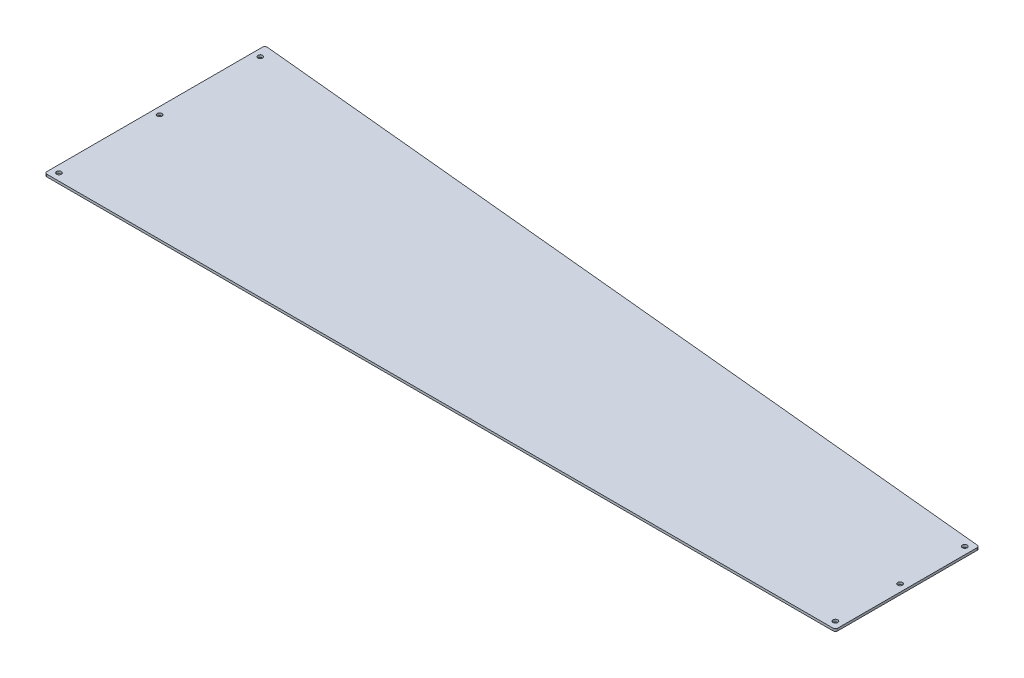
ISO-10303-21;
HEADER;
FILE_DESCRIPTION(('STEP AP214'),'2;1');
FILE_NAME('part.step','',(''),(''),'','','');
FILE_SCHEMA(('AUTOMOTIVE_DESIGN { 1 0 10303 214 1 1 1 1 }'));
ENDSEC;
DATA;
#1=APPLICATION_CONTEXT('core data for automotive mechanical design processes');
#2=APPLICATION_PROTOCOL_DEFINITION('international standard','automotive_design',2000,#1);
#3=PRODUCT_CONTEXT('',#1,'mechanical');
#4=PRODUCT('Part','Part','',(#3));
#5=PRODUCT_RELATED_PRODUCT_CATEGORY('part','',(#4));
#6=PRODUCT_DEFINITION_FORMATION('','',#4);
#7=PRODUCT_DEFINITION_CONTEXT('part definition',#1,'design');
#8=PRODUCT_DEFINITION('design','',#6,#7);
#9=PRODUCT_DEFINITION_SHAPE('','',#8);
#10=(LENGTH_UNIT() NAMED_UNIT(*) SI_UNIT(.MILLI.,.METRE.));
#11=(NAMED_UNIT(*) PLANE_ANGLE_UNIT() SI_UNIT($,.RADIAN.));
#12=(NAMED_UNIT(*) SI_UNIT($,.STERADIAN.) SOLID_ANGLE_UNIT());
#13=UNCERTAINTY_MEASURE_WITH_UNIT(LENGTH_MEASURE(1.E-05),#10,'distance_accuracy_value','');
#14=(GEOMETRIC_REPRESENTATION_CONTEXT(3) GLOBAL_UNCERTAINTY_ASSIGNED_CONTEXT((#13)) GLOBAL_UNIT_ASSIGNED_CONTEXT((#10,
#11,#12)) REPRESENTATION_CONTEXT('',''));
#15=CARTESIAN_POINT('',(0.,0.,0.));
#16=DIRECTION('',(0.,0.,1.));
#17=DIRECTION('',(1.,0.,0.));
#18=AXIS2_PLACEMENT_3D('',#15,#16,#17);
#19=CARTESIAN_POINT('',(413.585526315789,3.175,-75.1973684210526));
#20=DIRECTION('',(-1.,0.,0.));
#21=DIRECTION('',(0.,0.,1.));
#22=AXIS2_PLACEMENT_3D('',#19,#20,#21);
#23=PLANE('',#22);
#24=DIRECTION('',(0.,0.,-1.));
#25=VECTOR('',#24,1.);
#26=CARTESIAN_POINT('',(413.585526315789,3.175,-75.1973684210526));
#27=LINE('',#26,#25);
#28=CARTESIAN_POINT('',(413.585526315789,3.175,112.127631578947));
#29=VERTEX_POINT('',#28);
#30=CARTESIAN_POINT('',(413.585526315789,3.175,-72.3153546797032));
#31=VERTEX_POINT('',#30);
#32=EDGE_CURVE('E124',#29,#31,#27,.T.);
#33=ORIENTED_EDGE('',*,*,#32,.F.);
#34=DIRECTION('',(0.,-1.,0.));
#35=VECTOR('',#34,1.);
#36=CARTESIAN_POINT('',(413.585526315789,3.175,112.127631578947));
#37=LINE('',#36,#35);
#38=CARTESIAN_POINT('',(413.585526315789,0.,112.127631578947));
#39=VERTEX_POINT('',#38);
#40=EDGE_CURVE('E108',#29,#39,#37,.T.);
#41=ORIENTED_EDGE('',*,*,#40,.T.);
#42=DIRECTION('',(0.,0.,-1.));
#43=VECTOR('',#42,1.);
#44=CARTESIAN_POINT('',(413.585526315789,0.,-75.1973684210526));
#45=LINE('',#44,#43);
#46=CARTESIAN_POINT('',(413.585526315789,0.,-72.3153546797032));
#47=VERTEX_POINT('',#46);
#48=EDGE_CURVE('E121',#39,#47,#45,.T.);
#49=ORIENTED_EDGE('',*,*,#48,.T.);
#50=DIRECTION('',(0.,-1.,0.));
#51=VECTOR('',#50,1.);
#52=CARTESIAN_POINT('',(413.585526315789,3.175,-72.3153546797032));
#53=LINE('',#52,#51);
#54=EDGE_CURVE('E127',#47,#31,#53,.F.);
#55=ORIENTED_EDGE('',*,*,#54,.T.);
#56=EDGE_LOOP('',(#33,#41,#49,#55));
#57=FACE_BOUND('',#56,.T.);
#58=ADVANCED_FACE('F38',(#57),#23,.F.);
#59=CARTESIAN_POINT('',(-634.164473684211,3.175,-176.797368421053));
#60=DIRECTION('',(-0.0965169782548387,0.,0.995331338253024));
#61=DIRECTION('',(0.995331338253024,0.,0.0965169782548386));
#62=AXIS2_PLACEMENT_3D('',#59,#60,#61);
#63=PLANE('',#62);
#64=DIRECTION('',(-0.995331338253024,0.,-0.0965169782548386));
#65=VECTOR('',#64,1.);
#66=CARTESIAN_POINT('',(-634.164473684211,3.175,-176.797368421053));
#67=LINE('',#66,#65);
#68=CARTESIAN_POINT('',(410.716967721748,3.175,-75.4755316786566));
#69=VERTEX_POINT('',#68);
#70=CARTESIAN_POINT('',(-630.683032278251,3.175,-176.459774102899));
#71=VERTEX_POINT('',#70);
#72=EDGE_CURVE('E203',#69,#71,#67,.T.);
#73=ORIENTED_EDGE('',*,*,#72,.F.);
#74=DIRECTION('',(0.,-1.,0.));
#75=VECTOR('',#74,1.);
#76=CARTESIAN_POINT('',(410.716967721749,3.175,-75.4755316786566));
#77=LINE('',#76,#75);
#78=CARTESIAN_POINT('',(410.716967721748,0.,-75.4755316786566));
#79=VERTEX_POINT('',#78);
#80=EDGE_CURVE('E181',#69,#79,#77,.T.);
#81=ORIENTED_EDGE('',*,*,#80,.T.);
#82=DIRECTION('',(-0.995331338253024,0.,-0.0965169782548386));
#83=VECTOR('',#82,1.);
#84=CARTESIAN_POINT('',(-634.164473684211,0.,-176.797368421053));
#85=LINE('',#84,#83);
#86=CARTESIAN_POINT('',(-630.683032278251,0.,-176.459774102899));
#87=VERTEX_POINT('',#86);
#88=EDGE_CURVE('E132',#79,#87,#85,.T.);
#89=ORIENTED_EDGE('',*,*,#88,.T.);
#90=DIRECTION('',(0.,-1.,0.));
#91=VECTOR('',#90,1.);
#92=CARTESIAN_POINT('',(-630.683032278251,3.175,-176.459774102899));
#93=LINE('',#92,#91);
#94=EDGE_CURVE('E178',#87,#71,#93,.F.);
#95=ORIENTED_EDGE('',*,*,#94,.T.);
#96=EDGE_LOOP('',(#73,#81,#89,#95));
#97=FACE_BOUND('',#96,.T.);
#98=ADVANCED_FACE('F285',(#97),#63,.F.);
#99=CARTESIAN_POINT('',(-634.164473684211,3.175,-176.797368421053));
#100=DIRECTION('',(1.,0.,0.));
#101=DIRECTION('',(0.,0.,-1.));
#102=AXIS2_PLACEMENT_3D('',#99,#100,#101);
#103=PLANE('',#102);
#104=DIRECTION('',(0.,0.,1.));
#105=VECTOR('',#104,1.);
#106=CARTESIAN_POINT('',(-634.164473684211,0.,-176.797368421053));
#107=LINE('',#106,#105);
#108=CARTESIAN_POINT('',(-634.164473684211,0.,-173.299597103946));
#109=VERTEX_POINT('',#108);
#110=CARTESIAN_POINT('',(-634.164473684211,0.,112.127631578947));
#111=VERTEX_POINT('',#110);
#112=EDGE_CURVE('E139',#109,#111,#107,.T.);
#113=ORIENTED_EDGE('',*,*,#112,.T.);
#114=DIRECTION('',(0.,-1.,0.));
#115=VECTOR('',#114,1.);
#116=CARTESIAN_POINT('',(-634.164473684211,3.175,112.127631578947));
#117=LINE('',#116,#115);
#118=CARTESIAN_POINT('',(-634.164473684211,3.175,112.127631578947));
#119=VERTEX_POINT('',#118);
#120=EDGE_CURVE('E11',#111,#119,#117,.F.);
#121=ORIENTED_EDGE('',*,*,#120,.T.);
#122=DIRECTION('',(0.,0.,1.));
#123=VECTOR('',#122,1.);
#124=CARTESIAN_POINT('',(-634.164473684211,3.175,-176.797368421053));
#125=LINE('',#124,#123);
#126=CARTESIAN_POINT('',(-634.164473684211,3.175,-173.299597103946));
#127=VERTEX_POINT('',#126);
#128=EDGE_CURVE('E190',#127,#119,#125,.T.);
#129=ORIENTED_EDGE('',*,*,#128,.F.);
#130=DIRECTION('',(0.,-1.,0.));
#131=VECTOR('',#130,1.);
#132=CARTESIAN_POINT('',(-634.164473684211,3.175,-173.299597103946));
#133=LINE('',#132,#131);
#134=EDGE_CURVE('E47',#127,#109,#133,.T.);
#135=ORIENTED_EDGE('',*,*,#134,.T.);
#136=EDGE_LOOP('',(#113,#121,#129,#135));
#137=FACE_BOUND('',#136,.T.);
#138=ADVANCED_FACE('F189',(#137),#103,.F.);
#139=CARTESIAN_POINT('',(-634.164473684211,3.175,115.302631578947));
#140=DIRECTION('',(0.,0.,-1.));
#141=DIRECTION('',(-1.,0.,0.));
#142=AXIS2_PLACEMENT_3D('',#139,#140,#141);
#143=PLANE('',#142);
#144=DIRECTION('',(1.,0.,0.));
#145=VECTOR('',#144,1.);
#146=CARTESIAN_POINT('',(-634.164473684211,0.,115.302631578947));
#147=LINE('',#146,#145);
#148=CARTESIAN_POINT('',(-630.98947368421,0.,115.302631578947));
#149=VERTEX_POINT('',#148);
#150=CARTESIAN_POINT('',(410.41052631579,0.,115.302631578947));
#151=VERTEX_POINT('',#150);
#152=EDGE_CURVE('E150',#149,#151,#147,.T.);
#153=ORIENTED_EDGE('',*,*,#152,.T.);
#154=DIRECTION('',(0.,-1.,0.));
#155=VECTOR('',#154,1.);
#156=CARTESIAN_POINT('',(410.41052631579,3.175,115.302631578947));
#157=LINE('',#156,#155);
#158=CARTESIAN_POINT('',(410.41052631579,3.175,115.302631578947));
#159=VERTEX_POINT('',#158);
#160=EDGE_CURVE('E109',#151,#159,#157,.F.);
#161=ORIENTED_EDGE('',*,*,#160,.T.);
#162=DIRECTION('',(1.,0.,0.));
#163=VECTOR('',#162,1.);
#164=CARTESIAN_POINT('',(-634.164473684211,3.175,115.302631578947));
#165=LINE('',#164,#163);
#166=CARTESIAN_POINT('',(-630.98947368421,3.175,115.302631578947));
#167=VERTEX_POINT('',#166);
#168=EDGE_CURVE('E145',#167,#159,#165,.T.);
#169=ORIENTED_EDGE('',*,*,#168,.F.);
#170=DIRECTION('',(0.,-1.,0.));
#171=VECTOR('',#170,1.);
#172=CARTESIAN_POINT('',(-630.98947368421,3.175,115.302631578947));
#173=LINE('',#172,#171);
#174=EDGE_CURVE('E115',#167,#149,#173,.T.);
#175=ORIENTED_EDGE('',*,*,#174,.T.);
#176=EDGE_LOOP('',(#153,#161,#169,#175));
#177=FACE_BOUND('',#176,.T.);
#178=ADVANCED_FACE('F198',(#177),#143,.F.);
#179=CARTESIAN_POINT('',(0.,3.175,0.));
#180=DIRECTION('',(0.,1.,0.));
#181=DIRECTION('',(0.,0.,1.));
#182=AXIS2_PLACEMENT_3D('',#179,#180,#181);
#183=PLANE('',#182);
#184=CARTESIAN_POINT('',(404.06052631579,3.175,-65.6723684210526));
#185=DIRECTION('',(0.,1.,0.));
#186=DIRECTION('',(0.,0.,1.));
#187=AXIS2_PLACEMENT_3D('',#184,#185,#186);
#188=CIRCLE('',#187,3.17499999999998);
#189=CARTESIAN_POINT('',(404.06052631579,3.175,-62.4973684210526));
#190=VERTEX_POINT('',#189);
#191=EDGE_CURVE('E249',#190,#190,#188,.T.);
#192=ORIENTED_EDGE('',*,*,#191,.F.);
#193=EDGE_LOOP('',(#192));
#194=FACE_BOUND('',#193,.T.);
#195=CARTESIAN_POINT('',(404.06052631579,3.175,20.0526315789474));
#196=DIRECTION('',(0.,1.,0.));
#197=DIRECTION('',(0.,0.,1.));
#198=AXIS2_PLACEMENT_3D('',#195,#196,#197);
#199=CIRCLE('',#198,3.17499999999998);
#200=CARTESIAN_POINT('',(404.06052631579,3.175,23.2276315789474));
#201=VERTEX_POINT('',#200);
#202=EDGE_CURVE('E241',#201,#201,#199,.T.);
#203=ORIENTED_EDGE('',*,*,#202,.F.);
#204=EDGE_LOOP('',(#203));
#205=FACE_BOUND('',#204,.T.);
#206=CARTESIAN_POINT('',(404.06052631579,3.175,105.777631578947));
#207=DIRECTION('',(0.,1.,0.));
#208=DIRECTION('',(0.,0.,1.));
#209=AXIS2_PLACEMENT_3D('',#206,#207,#208);
#210=CIRCLE('',#209,3.17499999999998);
#211=CARTESIAN_POINT('',(404.06052631579,3.175,108.952631578947));
#212=VERTEX_POINT('',#211);
#213=EDGE_CURVE('E233',#212,#212,#210,.T.);
#214=ORIENTED_EDGE('',*,*,#213,.F.);
#215=EDGE_LOOP('',(#214));
#216=FACE_BOUND('',#215,.T.);
#217=CARTESIAN_POINT('',(-624.63947368421,3.175,105.777631578947));
#218=DIRECTION('',(0.,1.,0.));
#219=DIRECTION('',(0.,0.,1.));
#220=AXIS2_PLACEMENT_3D('',#217,#218,#219);
#221=CIRCLE('',#220,3.17500000000004);
#222=CARTESIAN_POINT('',(-624.63947368421,3.175,108.952631578947));
#223=VERTEX_POINT('',#222);
#224=EDGE_CURVE('E225',#223,#223,#221,.T.);
#225=ORIENTED_EDGE('',*,*,#224,.F.);
#226=EDGE_LOOP('',(#225));
#227=FACE_BOUND('',#226,.T.);
#228=CARTESIAN_POINT('',(-624.63947368421,3.175,-27.5723684210527));
#229=DIRECTION('',(0.,1.,0.));
#230=DIRECTION('',(0.,0.,1.));
#231=AXIS2_PLACEMENT_3D('',#228,#229,#230);
#232=CIRCLE('',#231,3.17500000000004);
#233=CARTESIAN_POINT('',(-624.63947368421,3.175,-24.3973684210526));
#234=VERTEX_POINT('',#233);
#235=EDGE_CURVE('E217',#234,#234,#232,.T.);
#236=ORIENTED_EDGE('',*,*,#235,.F.);
#237=EDGE_LOOP('',(#236));
#238=FACE_BOUND('',#237,.T.);
#239=CARTESIAN_POINT('',(-624.63947368421,3.175,-160.922368421053));
#240=DIRECTION('',(0.,1.,0.));
#241=DIRECTION('',(0.,0.,1.));
#242=AXIS2_PLACEMENT_3D('',#239,#240,#241);
#243=CIRCLE('',#242,3.17500000000004);
#244=CARTESIAN_POINT('',(-624.63947368421,3.175,-157.747368421053));
#245=VERTEX_POINT('',#244);
#246=EDGE_CURVE('E142',#245,#245,#243,.T.);
#247=ORIENTED_EDGE('',*,*,#246,.F.);
#248=EDGE_LOOP('',(#247));
#249=FACE_BOUND('',#248,.T.);
#250=ORIENTED_EDGE('',*,*,#168,.T.);
#251=CARTESIAN_POINT('',(410.41052631579,3.175,112.127631578947));
#252=DIRECTION('',(0.,1.,0.));
#253=DIRECTION('',(0.,0.,1.));
#254=AXIS2_PLACEMENT_3D('',#251,#252,#253);
#255=CIRCLE('',#254,3.175);
#256=EDGE_CURVE('E175',#159,#29,#255,.T.);
#257=ORIENTED_EDGE('',*,*,#256,.T.);
#258=ORIENTED_EDGE('',*,*,#32,.T.);
#259=CARTESIAN_POINT('',(410.410526315789,3.175,-72.3153546797032));
#260=DIRECTION('',(0.,1.,0.));
#261=DIRECTION('',(0.,0.,1.));
#262=AXIS2_PLACEMENT_3D('',#259,#260,#261);
#263=CIRCLE('',#262,3.175);
#264=EDGE_CURVE('E172',#31,#69,#263,.T.);
#265=ORIENTED_EDGE('',*,*,#264,.T.);
#266=ORIENTED_EDGE('',*,*,#72,.T.);
#267=CARTESIAN_POINT('',(-630.98947368421,3.175,-173.299597103946));
#268=DIRECTION('',(0.,1.,0.));
#269=DIRECTION('',(0.,0.,1.));
#270=AXIS2_PLACEMENT_3D('',#267,#268,#269);
#271=CIRCLE('',#270,3.175);
#272=EDGE_CURVE('E59',#71,#127,#271,.T.);
#273=ORIENTED_EDGE('',*,*,#272,.T.);
#274=ORIENTED_EDGE('',*,*,#128,.T.);
#275=CARTESIAN_POINT('',(-630.98947368421,3.175,112.127631578947));
#276=DIRECTION('',(0.,1.,0.));
#277=DIRECTION('',(0.,0.,1.));
#278=AXIS2_PLACEMENT_3D('',#275,#276,#277);
#279=CIRCLE('',#278,3.175);
#280=EDGE_CURVE('E169',#119,#167,#279,.T.);
#281=ORIENTED_EDGE('',*,*,#280,.T.);
#282=EDGE_LOOP('',(#250,#257,#258,#265,#266,#273,#274,#281));
#283=FACE_BOUND('',#282,.T.);
#284=ADVANCED_FACE('F257',(#194,#205,#216,#227,#238,#249,#283),#183,.T.);
#285=CARTESIAN_POINT('',(0.,0.,0.));
#286=DIRECTION('',(0.,1.,0.));
#287=DIRECTION('',(0.,0.,1.));
#288=AXIS2_PLACEMENT_3D('',#285,#286,#287);
#289=PLANE('',#288);
#290=CARTESIAN_POINT('',(404.06052631579,0.,-65.6723684210526));
#291=DIRECTION('',(0.,1.,0.));
#292=DIRECTION('',(0.,0.,1.));
#293=AXIS2_PLACEMENT_3D('',#290,#291,#292);
#294=CIRCLE('',#293,3.17499999999998);
#295=CARTESIAN_POINT('',(404.06052631579,0.,-62.4973684210526));
#296=VERTEX_POINT('',#295);
#297=EDGE_CURVE('E245',#296,#296,#294,.T.);
#298=ORIENTED_EDGE('',*,*,#297,.T.);
#299=EDGE_LOOP('',(#298));
#300=FACE_BOUND('',#299,.T.);
#301=CARTESIAN_POINT('',(404.06052631579,0.,20.0526315789474));
#302=DIRECTION('',(0.,1.,0.));
#303=DIRECTION('',(0.,0.,1.));
#304=AXIS2_PLACEMENT_3D('',#301,#302,#303);
#305=CIRCLE('',#304,3.17499999999998);
#306=CARTESIAN_POINT('',(404.06052631579,0.,23.2276315789474));
#307=VERTEX_POINT('',#306);
#308=EDGE_CURVE('E237',#307,#307,#305,.T.);
#309=ORIENTED_EDGE('',*,*,#308,.T.);
#310=EDGE_LOOP('',(#309));
#311=FACE_BOUND('',#310,.T.);
#312=CARTESIAN_POINT('',(404.06052631579,0.,105.777631578947));
#313=DIRECTION('',(0.,1.,0.));
#314=DIRECTION('',(0.,0.,1.));
#315=AXIS2_PLACEMENT_3D('',#312,#313,#314);
#316=CIRCLE('',#315,3.17499999999998);
#317=CARTESIAN_POINT('',(404.06052631579,0.,108.952631578947));
#318=VERTEX_POINT('',#317);
#319=EDGE_CURVE('E229',#318,#318,#316,.T.);
#320=ORIENTED_EDGE('',*,*,#319,.T.);
#321=EDGE_LOOP('',(#320));
#322=FACE_BOUND('',#321,.T.);
#323=CARTESIAN_POINT('',(-624.63947368421,0.,105.777631578947));
#324=DIRECTION('',(0.,1.,0.));
#325=DIRECTION('',(0.,0.,1.));
#326=AXIS2_PLACEMENT_3D('',#323,#324,#325);
#327=CIRCLE('',#326,3.17500000000004);
#328=CARTESIAN_POINT('',(-624.63947368421,0.,108.952631578947));
#329=VERTEX_POINT('',#328);
#330=EDGE_CURVE('E221',#329,#329,#327,.T.);
#331=ORIENTED_EDGE('',*,*,#330,.T.);
#332=EDGE_LOOP('',(#331));
#333=FACE_BOUND('',#332,.T.);
#334=CARTESIAN_POINT('',(-624.63947368421,0.,-27.5723684210527));
#335=DIRECTION('',(0.,1.,0.));
#336=DIRECTION('',(0.,0.,1.));
#337=AXIS2_PLACEMENT_3D('',#334,#335,#336);
#338=CIRCLE('',#337,3.17500000000004);
#339=CARTESIAN_POINT('',(-624.63947368421,0.,-24.3973684210526));
#340=VERTEX_POINT('',#339);
#341=EDGE_CURVE('E213',#340,#340,#338,.T.);
#342=ORIENTED_EDGE('',*,*,#341,.T.);
#343=EDGE_LOOP('',(#342));
#344=FACE_BOUND('',#343,.T.);
#345=CARTESIAN_POINT('',(-624.63947368421,0.,-160.922368421053));
#346=DIRECTION('',(0.,1.,0.));
#347=DIRECTION('',(0.,0.,1.));
#348=AXIS2_PLACEMENT_3D('',#345,#346,#347);
#349=CIRCLE('',#348,3.17500000000004);
#350=CARTESIAN_POINT('',(-624.63947368421,0.,-157.747368421053));
#351=VERTEX_POINT('',#350);
#352=EDGE_CURVE('E133',#351,#351,#349,.T.);
#353=ORIENTED_EDGE('',*,*,#352,.T.);
#354=EDGE_LOOP('',(#353));
#355=FACE_BOUND('',#354,.T.);
#356=ORIENTED_EDGE('',*,*,#48,.F.);
#357=CARTESIAN_POINT('',(410.41052631579,0.,112.127631578947));
#358=DIRECTION('',(0.,1.,0.));
#359=DIRECTION('',(0.,0.,1.));
#360=AXIS2_PLACEMENT_3D('',#357,#358,#359);
#361=CIRCLE('',#360,3.175);
#362=EDGE_CURVE('E104',#39,#151,#361,.F.);
#363=ORIENTED_EDGE('',*,*,#362,.T.);
#364=ORIENTED_EDGE('',*,*,#152,.F.);
#365=CARTESIAN_POINT('',(-630.98947368421,0.,112.127631578947));
#366=DIRECTION('',(0.,1.,0.));
#367=DIRECTION('',(0.,0.,1.));
#368=AXIS2_PLACEMENT_3D('',#365,#366,#367);
#369=CIRCLE('',#368,3.175);
#370=EDGE_CURVE('E157',#149,#111,#369,.F.);
#371=ORIENTED_EDGE('',*,*,#370,.T.);
#372=ORIENTED_EDGE('',*,*,#112,.F.);
#373=CARTESIAN_POINT('',(-630.98947368421,0.,-173.299597103946));
#374=DIRECTION('',(0.,1.,0.));
#375=DIRECTION('',(0.,0.,1.));
#376=AXIS2_PLACEMENT_3D('',#373,#374,#375);
#377=CIRCLE('',#376,3.175);
#378=EDGE_CURVE('E126',#109,#87,#377,.F.);
#379=ORIENTED_EDGE('',*,*,#378,.T.);
#380=ORIENTED_EDGE('',*,*,#88,.F.);
#381=CARTESIAN_POINT('',(410.410526315789,0.,-72.3153546797032));
#382=DIRECTION('',(0.,1.,0.));
#383=DIRECTION('',(0.,0.,1.));
#384=AXIS2_PLACEMENT_3D('',#381,#382,#383);
#385=CIRCLE('',#384,3.175);
#386=EDGE_CURVE('E116',#79,#47,#385,.F.);
#387=ORIENTED_EDGE('',*,*,#386,.T.);
#388=EDGE_LOOP('',(#356,#363,#364,#371,#372,#379,#380,#387));
#389=FACE_BOUND('',#388,.T.);
#390=ADVANCED_FACE('F129',(#300,#311,#322,#333,#344,#355,#389),#289,.F.);
#391=CARTESIAN_POINT('',(410.41052631579,3.175,112.127631578947));
#392=DIRECTION('',(0.,-1.,0.));
#393=DIRECTION('',(0.,0.,-1.));
#394=AXIS2_PLACEMENT_3D('',#391,#392,#393);
#395=CYLINDRICAL_SURFACE('',#394,3.175);
#396=ORIENTED_EDGE('',*,*,#256,.F.);
#397=ORIENTED_EDGE('',*,*,#160,.F.);
#398=ORIENTED_EDGE('',*,*,#362,.F.);
#399=ORIENTED_EDGE('',*,*,#40,.F.);
#400=EDGE_LOOP('',(#396,#397,#398,#399));
#401=FACE_BOUND('',#400,.T.);
#402=ADVANCED_FACE('F107',(#401),#395,.T.);
#403=CARTESIAN_POINT('',(410.410526315789,3.175,-72.3153546797032));
#404=DIRECTION('',(0.,-1.,0.));
#405=DIRECTION('',(0.,0.,-1.));
#406=AXIS2_PLACEMENT_3D('',#403,#404,#405);
#407=CYLINDRICAL_SURFACE('',#406,3.175);
#408=ORIENTED_EDGE('',*,*,#264,.F.);
#409=ORIENTED_EDGE('',*,*,#54,.F.);
#410=ORIENTED_EDGE('',*,*,#386,.F.);
#411=ORIENTED_EDGE('',*,*,#80,.F.);
#412=EDGE_LOOP('',(#408,#409,#410,#411));
#413=FACE_BOUND('',#412,.T.);
#414=ADVANCED_FACE('F296',(#413),#407,.T.);
#415=CARTESIAN_POINT('',(-630.98947368421,3.175,112.127631578947));
#416=DIRECTION('',(0.,-1.,0.));
#417=DIRECTION('',(0.,0.,-1.));
#418=AXIS2_PLACEMENT_3D('',#415,#416,#417);
#419=CYLINDRICAL_SURFACE('',#418,3.175);
#420=ORIENTED_EDGE('',*,*,#280,.F.);
#421=ORIENTED_EDGE('',*,*,#120,.F.);
#422=ORIENTED_EDGE('',*,*,#370,.F.);
#423=ORIENTED_EDGE('',*,*,#174,.F.);
#424=EDGE_LOOP('',(#420,#421,#422,#423));
#425=FACE_BOUND('',#424,.T.);
#426=ADVANCED_FACE('F195',(#425),#419,.T.);
#427=CARTESIAN_POINT('',(-630.98947368421,3.175,-173.299597103946));
#428=DIRECTION('',(0.,-1.,0.));
#429=DIRECTION('',(0.,0.,-1.));
#430=AXIS2_PLACEMENT_3D('',#427,#428,#429);
#431=CYLINDRICAL_SURFACE('',#430,3.175);
#432=ORIENTED_EDGE('',*,*,#272,.F.);
#433=ORIENTED_EDGE('',*,*,#94,.F.);
#434=ORIENTED_EDGE('',*,*,#378,.F.);
#435=ORIENTED_EDGE('',*,*,#134,.F.);
#436=EDGE_LOOP('',(#432,#433,#434,#435));
#437=FACE_BOUND('',#436,.T.);
#438=ADVANCED_FACE('F40',(#437),#431,.T.);
#439=CARTESIAN_POINT('',(-624.63947368421,3.175,-160.922368421053));
#440=DIRECTION('',(0.,1.,0.));
#441=DIRECTION('',(0.,0.,1.));
#442=AXIS2_PLACEMENT_3D('',#439,#440,#441);
#443=CYLINDRICAL_SURFACE('',#442,3.17500000000004);
#444=ORIENTED_EDGE('',*,*,#352,.F.);
#445=EDGE_LOOP('',(#444));
#446=FACE_BOUND('',#445,.T.);
#447=ORIENTED_EDGE('',*,*,#246,.T.);
#448=EDGE_LOOP('',(#447));
#449=FACE_BOUND('',#448,.T.);
#450=ADVANCED_FACE('F271',(#446,#449),#443,.F.);
#451=CARTESIAN_POINT('',(-624.63947368421,3.175,-27.5723684210527));
#452=DIRECTION('',(0.,1.,0.));
#453=DIRECTION('',(0.,0.,1.));
#454=AXIS2_PLACEMENT_3D('',#451,#452,#453);
#455=CYLINDRICAL_SURFACE('',#454,3.17500000000004);
#456=ORIENTED_EDGE('',*,*,#341,.F.);
#457=EDGE_LOOP('',(#456));
#458=FACE_BOUND('',#457,.T.);
#459=ORIENTED_EDGE('',*,*,#235,.T.);
#460=EDGE_LOOP('',(#459));
#461=FACE_BOUND('',#460,.T.);
#462=ADVANCED_FACE('F273',(#458,#461),#455,.F.);
#463=CARTESIAN_POINT('',(-624.63947368421,3.175,105.777631578947));
#464=DIRECTION('',(0.,1.,0.));
#465=DIRECTION('',(0.,0.,1.));
#466=AXIS2_PLACEMENT_3D('',#463,#464,#465);
#467=CYLINDRICAL_SURFACE('',#466,3.17500000000004);
#468=ORIENTED_EDGE('',*,*,#330,.F.);
#469=EDGE_LOOP('',(#468));
#470=FACE_BOUND('',#469,.T.);
#471=ORIENTED_EDGE('',*,*,#224,.T.);
#472=EDGE_LOOP('',(#471));
#473=FACE_BOUND('',#472,.T.);
#474=ADVANCED_FACE('F280',(#470,#473),#467,.F.);
#475=CARTESIAN_POINT('',(404.06052631579,3.175,105.777631578947));
#476=DIRECTION('',(0.,1.,0.));
#477=DIRECTION('',(0.,0.,1.));
#478=AXIS2_PLACEMENT_3D('',#475,#476,#477);
#479=CYLINDRICAL_SURFACE('',#478,3.17499999999998);
#480=ORIENTED_EDGE('',*,*,#319,.F.);
#481=EDGE_LOOP('',(#480));
#482=FACE_BOUND('',#481,.T.);
#483=ORIENTED_EDGE('',*,*,#213,.T.);
#484=EDGE_LOOP('',(#483));
#485=FACE_BOUND('',#484,.T.);
#486=ADVANCED_FACE('F329',(#482,#485),#479,.F.);
#487=CARTESIAN_POINT('',(404.06052631579,3.175,20.0526315789474));
#488=DIRECTION('',(0.,1.,0.));
#489=DIRECTION('',(0.,0.,1.));
#490=AXIS2_PLACEMENT_3D('',#487,#488,#489);
#491=CYLINDRICAL_SURFACE('',#490,3.17499999999998);
#492=ORIENTED_EDGE('',*,*,#308,.F.);
#493=EDGE_LOOP('',(#492));
#494=FACE_BOUND('',#493,.T.);
#495=ORIENTED_EDGE('',*,*,#202,.T.);
#496=EDGE_LOOP('',(#495));
#497=FACE_BOUND('',#496,.T.);
#498=ADVANCED_FACE('F339',(#494,#497),#491,.F.);
#499=CARTESIAN_POINT('',(404.06052631579,3.175,-65.6723684210526));
#500=DIRECTION('',(0.,1.,0.));
#501=DIRECTION('',(0.,0.,1.));
#502=AXIS2_PLACEMENT_3D('',#499,#500,#501);
#503=CYLINDRICAL_SURFACE('',#502,3.17499999999998);
#504=ORIENTED_EDGE('',*,*,#297,.F.);
#505=EDGE_LOOP('',(#504));
#506=FACE_BOUND('',#505,.T.);
#507=ORIENTED_EDGE('',*,*,#191,.T.);
#508=EDGE_LOOP('',(#507));
#509=FACE_BOUND('',#508,.T.);
#510=ADVANCED_FACE('F255',(#506,#509),#503,.F.);
#511=CLOSED_SHELL('',(#58,#98,#138,#178,#284,#390,#402,#414,#426,#438,#450,#462,#474,#486,#498,#510));
#512=MANIFOLD_SOLID_BREP('B2',#511);
#513=ADVANCED_BREP_SHAPE_REPRESENTATION('',(#18,#512),#14);
#514=SHAPE_DEFINITION_REPRESENTATION(#9,#513);
ENDSEC;
END-ISO-10303-21;
